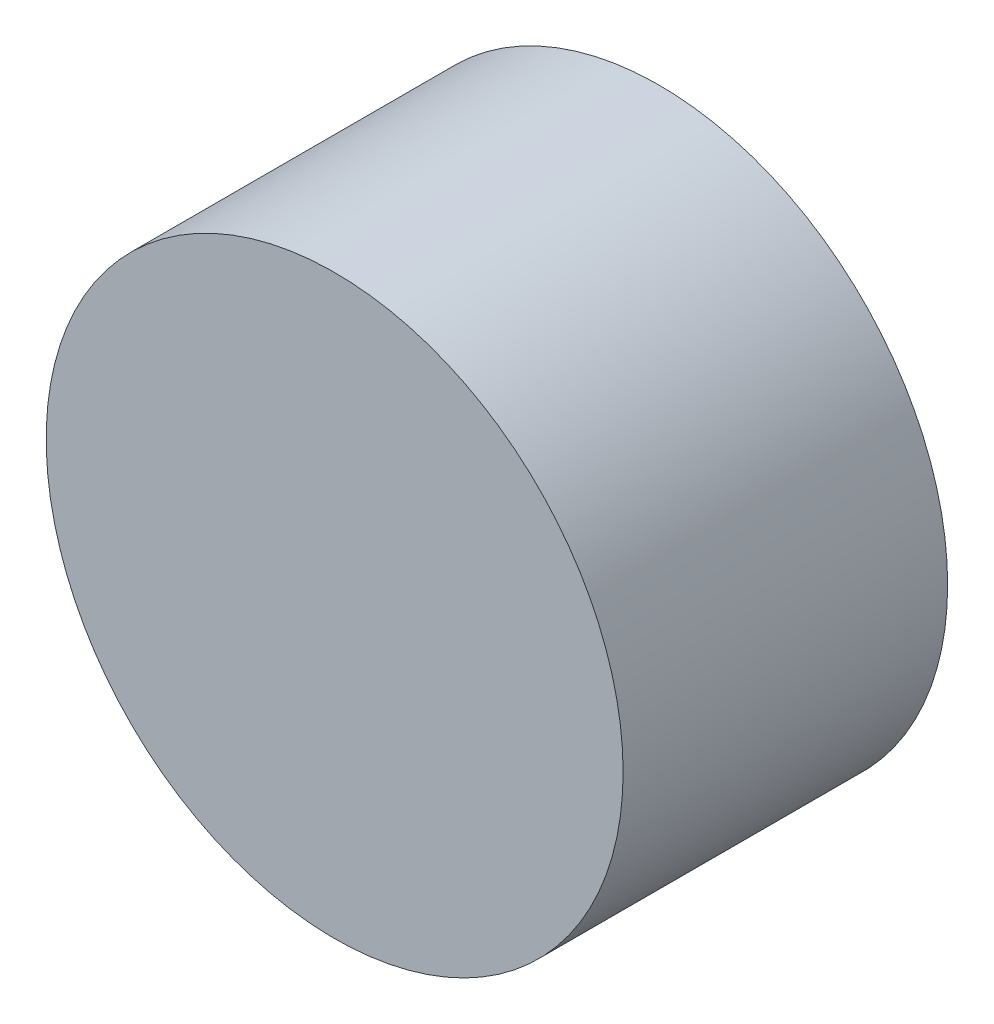
ISO-10303-21;
HEADER;
FILE_DESCRIPTION(('STEP AP214'),'2;1');
FILE_NAME('part.step','',(''),(''),'','','');
FILE_SCHEMA(('AUTOMOTIVE_DESIGN { 1 0 10303 214 1 1 1 1 }'));
ENDSEC;
DATA;
#1=APPLICATION_CONTEXT('core data for automotive mechanical design processes');
#2=APPLICATION_PROTOCOL_DEFINITION('international standard','automotive_design',2000,#1);
#3=PRODUCT_CONTEXT('',#1,'mechanical');
#4=PRODUCT('Part','Part','',(#3));
#5=PRODUCT_RELATED_PRODUCT_CATEGORY('part','',(#4));
#6=PRODUCT_DEFINITION_FORMATION('','',#4);
#7=PRODUCT_DEFINITION_CONTEXT('part definition',#1,'design');
#8=PRODUCT_DEFINITION('design','',#6,#7);
#9=PRODUCT_DEFINITION_SHAPE('','',#8);
#10=(LENGTH_UNIT() NAMED_UNIT(*) SI_UNIT(.MILLI.,.METRE.));
#11=(NAMED_UNIT(*) PLANE_ANGLE_UNIT() SI_UNIT($,.RADIAN.));
#12=(NAMED_UNIT(*) SI_UNIT($,.STERADIAN.) SOLID_ANGLE_UNIT());
#13=UNCERTAINTY_MEASURE_WITH_UNIT(LENGTH_MEASURE(1.E-05),#10,'distance_accuracy_value','');
#14=(GEOMETRIC_REPRESENTATION_CONTEXT(3) GLOBAL_UNCERTAINTY_ASSIGNED_CONTEXT((#13)) GLOBAL_UNIT_ASSIGNED_CONTEXT((#10,
#11,#12)) REPRESENTATION_CONTEXT('',''));
#15=CARTESIAN_POINT('',(0.,0.,0.));
#16=DIRECTION('',(0.,0.,1.));
#17=DIRECTION('',(1.,0.,0.));
#18=AXIS2_PLACEMENT_3D('',#15,#16,#17);
#19=CARTESIAN_POINT('',(0.,0.,36.));
#20=DIRECTION('',(0.,0.,-1.));
#21=DIRECTION('',(-1.,0.,0.));
#22=AXIS2_PLACEMENT_3D('',#19,#20,#21);
#23=CYLINDRICAL_SURFACE('',#22,32.);
#24=CARTESIAN_POINT('',(0.,0.,36.));
#25=DIRECTION('',(0.,0.,1.));
#26=DIRECTION('',(1.,0.,0.));
#27=AXIS2_PLACEMENT_3D('',#24,#25,#26);
#28=CIRCLE('',#27,32.);
#29=CARTESIAN_POINT('',(32.,0.,36.));
#30=VERTEX_POINT('',#29);
#31=EDGE_CURVE('E10',#30,#30,#28,.T.);
#32=ORIENTED_EDGE('',*,*,#31,.F.);
#33=EDGE_LOOP('',(#32));
#34=FACE_BOUND('',#33,.T.);
#35=CARTESIAN_POINT('',(0.,0.,0.));
#36=DIRECTION('',(0.,0.,1.));
#37=DIRECTION('',(1.,0.,0.));
#38=AXIS2_PLACEMENT_3D('',#35,#36,#37);
#39=CIRCLE('',#38,32.);
#40=CARTESIAN_POINT('',(32.,0.,0.));
#41=VERTEX_POINT('',#40);
#42=EDGE_CURVE('E40',#41,#41,#39,.T.);
#43=ORIENTED_EDGE('',*,*,#42,.T.);
#44=EDGE_LOOP('',(#43));
#45=FACE_BOUND('',#44,.T.);
#46=ADVANCED_FACE('F37',(#34,#45),#23,.T.);
#47=CARTESIAN_POINT('',(0.,0.,36.));
#48=DIRECTION('',(0.,0.,1.));
#49=DIRECTION('',(1.,0.,0.));
#50=AXIS2_PLACEMENT_3D('',#47,#48,#49);
#51=PLANE('',#50);
#52=ORIENTED_EDGE('',*,*,#31,.T.);
#53=EDGE_LOOP('',(#52));
#54=FACE_BOUND('',#53,.T.);
#55=ADVANCED_FACE('F52',(#54),#51,.T.);
#56=CARTESIAN_POINT('',(0.,0.,0.));
#57=DIRECTION('',(0.,0.,1.));
#58=DIRECTION('',(1.,0.,0.));
#59=AXIS2_PLACEMENT_3D('',#56,#57,#58);
#60=PLANE('',#59);
#61=ORIENTED_EDGE('',*,*,#42,.F.);
#62=EDGE_LOOP('',(#61));
#63=FACE_BOUND('',#62,.T.);
#64=ADVANCED_FACE('F50',(#63),#60,.F.);
#65=CLOSED_SHELL('',(#46,#55,#64));
#66=MANIFOLD_SOLID_BREP('B2',#65);
#67=ADVANCED_BREP_SHAPE_REPRESENTATION('',(#18,#66),#14);
#68=SHAPE_DEFINITION_REPRESENTATION(#9,#67);
ENDSEC;
END-ISO-10303-21;
